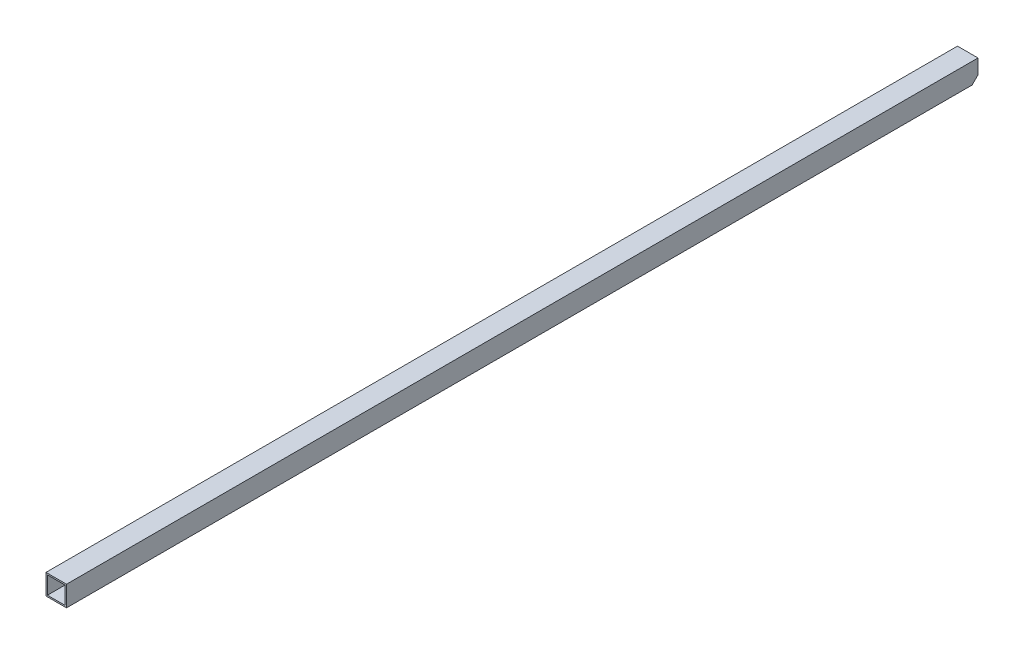
ISO-10303-21;
HEADER;
FILE_DESCRIPTION(('STEP AP214'),'2;1');
FILE_NAME('part.step','',(''),(''),'','','');
FILE_SCHEMA(('AUTOMOTIVE_DESIGN { 1 0 10303 214 1 1 1 1 }'));
ENDSEC;
DATA;
#1=APPLICATION_CONTEXT('core data for automotive mechanical design processes');
#2=APPLICATION_PROTOCOL_DEFINITION('international standard','automotive_design',2000,#1);
#3=PRODUCT_CONTEXT('',#1,'mechanical');
#4=PRODUCT('Part','Part','',(#3));
#5=PRODUCT_RELATED_PRODUCT_CATEGORY('part','',(#4));
#6=PRODUCT_DEFINITION_FORMATION('','',#4);
#7=PRODUCT_DEFINITION_CONTEXT('part definition',#1,'design');
#8=PRODUCT_DEFINITION('design','',#6,#7);
#9=PRODUCT_DEFINITION_SHAPE('','',#8);
#10=(LENGTH_UNIT() NAMED_UNIT(*) SI_UNIT(.MILLI.,.METRE.));
#11=(NAMED_UNIT(*) PLANE_ANGLE_UNIT() SI_UNIT($,.RADIAN.));
#12=(NAMED_UNIT(*) SI_UNIT($,.STERADIAN.) SOLID_ANGLE_UNIT());
#13=UNCERTAINTY_MEASURE_WITH_UNIT(LENGTH_MEASURE(1.E-05),#10,'distance_accuracy_value','');
#14=(GEOMETRIC_REPRESENTATION_CONTEXT(3) GLOBAL_UNCERTAINTY_ASSIGNED_CONTEXT((#13)) GLOBAL_UNIT_ASSIGNED_CONTEXT((#10,
#11,#12)) REPRESENTATION_CONTEXT('',''));
#15=CARTESIAN_POINT('',(0.,0.,0.));
#16=DIRECTION('',(0.,0.,1.));
#17=DIRECTION('',(1.,0.,0.));
#18=AXIS2_PLACEMENT_3D('',#15,#16,#17);
#19=CARTESIAN_POINT('',(473.075,9.525,87.043852545321));
#20=DIRECTION('',(0.,1.,0.));
#21=DIRECTION('',(0.,0.,1.));
#22=AXIS2_PLACEMENT_3D('',#19,#20,#21);
#23=PLANE('',#22);
#24=DIRECTION('',(0.,0.,-1.));
#25=VECTOR('',#24,1.);
#26=CARTESIAN_POINT('',(476.25,9.525,990.6));
#27=LINE('',#26,#25);
#28=CARTESIAN_POINT('',(476.25,9.525,1981.2));
#29=VERTEX_POINT('',#28);
#30=CARTESIAN_POINT('',(476.25,9.525,15.875));
#31=VERTEX_POINT('',#30);
#32=EDGE_CURVE('E17',#29,#31,#27,.T.);
#33=ORIENTED_EDGE('',*,*,#32,.F.);
#34=DIRECTION('',(-1.,0.,0.));
#35=VECTOR('',#34,1.);
#36=CARTESIAN_POINT('',(473.075,9.525,1981.2));
#37=LINE('',#36,#35);
#38=CARTESIAN_POINT('',(514.35,9.525,1981.2));
#39=VERTEX_POINT('',#38);
#40=EDGE_CURVE('E152',#29,#39,#37,.F.);
#41=ORIENTED_EDGE('',*,*,#40,.T.);
#42=DIRECTION('',(0.,0.,-1.));
#43=VECTOR('',#42,1.);
#44=CARTESIAN_POINT('',(514.35,9.525,990.6));
#45=LINE('',#44,#43);
#46=CARTESIAN_POINT('',(514.35,9.52500000000001,15.875));
#47=VERTEX_POINT('',#46);
#48=EDGE_CURVE('E109',#39,#47,#45,.T.);
#49=ORIENTED_EDGE('',*,*,#48,.T.);
#50=DIRECTION('',(1.,0.,0.));
#51=VECTOR('',#50,1.);
#52=CARTESIAN_POINT('',(473.075,9.525,15.875));
#53=LINE('',#52,#51);
#54=EDGE_CURVE('E87',#47,#31,#53,.F.);
#55=ORIENTED_EDGE('',*,*,#54,.T.);
#56=EDGE_LOOP('',(#33,#41,#49,#55));
#57=FACE_BOUND('',#56,.T.);
#58=ADVANCED_FACE('F14',(#57),#23,.T.);
#59=CARTESIAN_POINT('',(476.25,38.1,990.6));
#60=DIRECTION('',(1.,0.,0.));
#61=DIRECTION('',(0.,0.,-1.));
#62=AXIS2_PLACEMENT_3D('',#59,#60,#61);
#63=PLANE('',#62);
#64=DIRECTION('',(0.,1.,0.));
#65=VECTOR('',#64,1.);
#66=CARTESIAN_POINT('',(476.25,28.8192334502936,1981.2));
#67=LINE('',#66,#65);
#68=CARTESIAN_POINT('',(476.25,47.6249999999999,1981.2));
#69=VERTEX_POINT('',#68);
#70=EDGE_CURVE('E97',#69,#29,#67,.F.);
#71=ORIENTED_EDGE('',*,*,#70,.T.);
#72=ORIENTED_EDGE('',*,*,#32,.T.);
#73=DIRECTION('',(0.,-0.707106781186548,0.707106781186547));
#74=VECTOR('',#73,1.);
#75=CARTESIAN_POINT('',(476.25,6.56357332000069,18.8364266799993));
#76=LINE('',#75,#74);
#77=CARTESIAN_POINT('',(476.25,19.05,6.34999999999999));
#78=VERTEX_POINT('',#77);
#79=EDGE_CURVE('E94',#31,#78,#76,.F.);
#80=ORIENTED_EDGE('',*,*,#79,.T.);
#81=DIRECTION('',(0.,-1.,0.));
#82=VECTOR('',#81,1.);
#83=CARTESIAN_POINT('',(476.25,41.275,6.35));
#84=LINE('',#83,#82);
#85=CARTESIAN_POINT('',(476.25,47.625,6.34999999999998));
#86=VERTEX_POINT('',#85);
#87=EDGE_CURVE('E127',#78,#86,#84,.F.);
#88=ORIENTED_EDGE('',*,*,#87,.T.);
#89=DIRECTION('',(0.,0.,-1.));
#90=VECTOR('',#89,1.);
#91=CARTESIAN_POINT('',(476.25,47.625,75.4673129796982));
#92=LINE('',#91,#90);
#93=EDGE_CURVE('E101',#69,#86,#92,.T.);
#94=ORIENTED_EDGE('',*,*,#93,.F.);
#95=EDGE_LOOP('',(#71,#72,#80,#88,#94));
#96=FACE_BOUND('',#95,.T.);
#97=ADVANCED_FACE('F92',(#96),#63,.T.);
#98=CARTESIAN_POINT('',(473.075,47.625,75.4673129796982));
#99=DIRECTION('',(0.,-1.,0.));
#100=DIRECTION('',(0.,0.,-1.));
#101=AXIS2_PLACEMENT_3D('',#98,#99,#100);
#102=PLANE('',#101);
#103=ORIENTED_EDGE('',*,*,#93,.T.);
#104=DIRECTION('',(1.,0.,0.));
#105=VECTOR('',#104,1.);
#106=CARTESIAN_POINT('',(473.075,47.625,6.35));
#107=LINE('',#106,#105);
#108=CARTESIAN_POINT('',(514.35,47.625,6.34999999999999));
#109=VERTEX_POINT('',#108);
#110=EDGE_CURVE('E122',#86,#109,#107,.T.);
#111=ORIENTED_EDGE('',*,*,#110,.T.);
#112=DIRECTION('',(0.,0.,-1.));
#113=VECTOR('',#112,1.);
#114=CARTESIAN_POINT('',(514.35,47.625,990.6));
#115=LINE('',#114,#113);
#116=CARTESIAN_POINT('',(514.35,47.6249999999999,1981.2));
#117=VERTEX_POINT('',#116);
#118=EDGE_CURVE('E112',#109,#117,#115,.F.);
#119=ORIENTED_EDGE('',*,*,#118,.T.);
#120=DIRECTION('',(-1.,0.,0.));
#121=VECTOR('',#120,1.);
#122=CARTESIAN_POINT('',(473.075,47.625,1981.2));
#123=LINE('',#122,#121);
#124=EDGE_CURVE('E123',#117,#69,#123,.T.);
#125=ORIENTED_EDGE('',*,*,#124,.T.);
#126=EDGE_LOOP('',(#103,#111,#119,#125));
#127=FACE_BOUND('',#126,.T.);
#128=ADVANCED_FACE('F121',(#127),#102,.T.);
#129=CARTESIAN_POINT('',(514.35,38.1,990.6));
#130=DIRECTION('',(1.,0.,0.));
#131=DIRECTION('',(0.,0.,-1.));
#132=AXIS2_PLACEMENT_3D('',#129,#130,#131);
#133=PLANE('',#132);
#134=ORIENTED_EDGE('',*,*,#48,.F.);
#135=DIRECTION('',(0.,1.,0.));
#136=VECTOR('',#135,1.);
#137=CARTESIAN_POINT('',(514.35,28.8192334502936,1981.2));
#138=LINE('',#137,#136);
#139=EDGE_CURVE('E149',#39,#117,#138,.T.);
#140=ORIENTED_EDGE('',*,*,#139,.T.);
#141=ORIENTED_EDGE('',*,*,#118,.F.);
#142=DIRECTION('',(0.,-1.,0.));
#143=VECTOR('',#142,1.);
#144=CARTESIAN_POINT('',(514.35,41.275,6.35));
#145=LINE('',#144,#143);
#146=CARTESIAN_POINT('',(514.35,19.05,6.34999999999999));
#147=VERTEX_POINT('',#146);
#148=EDGE_CURVE('E130',#109,#147,#145,.T.);
#149=ORIENTED_EDGE('',*,*,#148,.T.);
#150=DIRECTION('',(0.,-0.707106781186548,0.707106781186547));
#151=VECTOR('',#150,1.);
#152=CARTESIAN_POINT('',(514.35,6.56357332000069,18.8364266799993));
#153=LINE('',#152,#151);
#154=EDGE_CURVE('E107',#147,#47,#153,.T.);
#155=ORIENTED_EDGE('',*,*,#154,.T.);
#156=EDGE_LOOP('',(#134,#140,#141,#149,#155));
#157=FACE_BOUND('',#156,.T.);
#158=ADVANCED_FACE('F160',(#157),#133,.F.);
#159=CARTESIAN_POINT('',(473.075,6.56357332000069,18.8364266799993));
#160=DIRECTION('',(0.,0.707106781186547,0.707106781186548));
#161=DIRECTION('',(0.,-0.707106781186548,0.707106781186547));
#162=AXIS2_PLACEMENT_3D('',#159,#160,#161);
#163=PLANE('',#162);
#164=DIRECTION('',(1.,0.,0.));
#165=VECTOR('',#164,1.);
#166=CARTESIAN_POINT('',(473.075,19.05,6.35));
#167=LINE('',#166,#165);
#168=CARTESIAN_POINT('',(517.525,19.05,6.34999999999999));
#169=VERTEX_POINT('',#168);
#170=EDGE_CURVE('E139',#147,#169,#167,.T.);
#171=ORIENTED_EDGE('',*,*,#170,.T.);
#172=DIRECTION('',(0.,0.707106781186546,-0.707106781186549));
#173=VECTOR('',#172,1.);
#174=CARTESIAN_POINT('',(517.525,6.35,19.05));
#175=LINE('',#174,#173);
#176=CARTESIAN_POINT('',(517.525,6.35,19.05));
#177=VERTEX_POINT('',#176);
#178=EDGE_CURVE('E166',#177,#169,#175,.T.);
#179=ORIENTED_EDGE('',*,*,#178,.F.);
#180=DIRECTION('',(1.,0.,0.));
#181=VECTOR('',#180,1.);
#182=CARTESIAN_POINT('',(473.075,6.35,19.05));
#183=LINE('',#182,#181);
#184=CARTESIAN_POINT('',(473.075,6.35,19.05));
#185=VERTEX_POINT('',#184);
#186=EDGE_CURVE('E158',#177,#185,#183,.F.);
#187=ORIENTED_EDGE('',*,*,#186,.T.);
#188=DIRECTION('',(0.,0.707106781186546,-0.707106781186549));
#189=VECTOR('',#188,1.);
#190=CARTESIAN_POINT('',(473.075,6.35,19.05));
#191=LINE('',#190,#189);
#192=CARTESIAN_POINT('',(473.075,19.05,6.34999999999998));
#193=VERTEX_POINT('',#192);
#194=EDGE_CURVE('E141',#185,#193,#191,.T.);
#195=ORIENTED_EDGE('',*,*,#194,.T.);
#196=DIRECTION('',(1.,0.,0.));
#197=VECTOR('',#196,1.);
#198=CARTESIAN_POINT('',(473.075,19.05,6.35));
#199=LINE('',#198,#197);
#200=EDGE_CURVE('E106',#193,#78,#199,.T.);
#201=ORIENTED_EDGE('',*,*,#200,.T.);
#202=ORIENTED_EDGE('',*,*,#79,.F.);
#203=ORIENTED_EDGE('',*,*,#54,.F.);
#204=ORIENTED_EDGE('',*,*,#154,.F.);
#205=EDGE_LOOP('',(#171,#179,#187,#195,#201,#202,#203,#204));
#206=FACE_BOUND('',#205,.T.);
#207=ADVANCED_FACE('F104',(#206),#163,.F.);
#208=CARTESIAN_POINT('',(473.075,6.35,87.043852545321));
#209=DIRECTION('',(0.,1.,0.));
#210=DIRECTION('',(0.,0.,1.));
#211=AXIS2_PLACEMENT_3D('',#208,#209,#210);
#212=PLANE('',#211);
#213=DIRECTION('',(-1.,0.,0.));
#214=VECTOR('',#213,1.);
#215=CARTESIAN_POINT('',(473.075,6.35,1981.2));
#216=LINE('',#215,#214);
#217=CARTESIAN_POINT('',(517.525,6.35,1981.2));
#218=VERTEX_POINT('',#217);
#219=CARTESIAN_POINT('',(473.075,6.35,1981.2));
#220=VERTEX_POINT('',#219);
#221=EDGE_CURVE('E156',#218,#220,#216,.T.);
#222=ORIENTED_EDGE('',*,*,#221,.T.);
#223=DIRECTION('',(0.,0.,-1.));
#224=VECTOR('',#223,1.);
#225=CARTESIAN_POINT('',(473.075,6.35,990.6));
#226=LINE('',#225,#224);
#227=EDGE_CURVE('E143',#220,#185,#226,.T.);
#228=ORIENTED_EDGE('',*,*,#227,.T.);
#229=ORIENTED_EDGE('',*,*,#186,.F.);
#230=DIRECTION('',(0.,0.,-1.));
#231=VECTOR('',#230,1.);
#232=CARTESIAN_POINT('',(517.525,6.35,990.6));
#233=LINE('',#232,#231);
#234=EDGE_CURVE('E169',#218,#177,#233,.T.);
#235=ORIENTED_EDGE('',*,*,#234,.F.);
#236=EDGE_LOOP('',(#222,#228,#229,#235));
#237=FACE_BOUND('',#236,.T.);
#238=ADVANCED_FACE('F207',(#237),#212,.F.);
#239=CARTESIAN_POINT('',(473.075,28.8192334502936,1981.2));
#240=DIRECTION('',(0.,0.,-1.));
#241=DIRECTION('',(-1.,0.,0.));
#242=AXIS2_PLACEMENT_3D('',#239,#240,#241);
#243=PLANE('',#242);
#244=ORIENTED_EDGE('',*,*,#40,.F.);
#245=ORIENTED_EDGE('',*,*,#70,.F.);
#246=ORIENTED_EDGE('',*,*,#124,.F.);
#247=ORIENTED_EDGE('',*,*,#139,.F.);
#248=EDGE_LOOP('',(#244,#245,#246,#247));
#249=FACE_BOUND('',#248,.T.);
#250=DIRECTION('',(1.,0.,0.));
#251=VECTOR('',#250,1.);
#252=CARTESIAN_POINT('',(473.075,50.7999999999998,1981.2));
#253=LINE('',#252,#251);
#254=CARTESIAN_POINT('',(517.525,50.7999999999999,1981.2));
#255=VERTEX_POINT('',#254);
#256=CARTESIAN_POINT('',(473.075,50.7999999999999,1981.2));
#257=VERTEX_POINT('',#256);
#258=EDGE_CURVE('E175',#255,#257,#253,.F.);
#259=ORIENTED_EDGE('',*,*,#258,.T.);
#260=DIRECTION('',(0.,1.,0.));
#261=VECTOR('',#260,1.);
#262=CARTESIAN_POINT('',(473.075,38.1,1981.2));
#263=LINE('',#262,#261);
#264=EDGE_CURVE('E146',#257,#220,#263,.F.);
#265=ORIENTED_EDGE('',*,*,#264,.T.);
#266=ORIENTED_EDGE('',*,*,#221,.F.);
#267=DIRECTION('',(0.,1.,0.));
#268=VECTOR('',#267,1.);
#269=CARTESIAN_POINT('',(517.525,38.1,1981.2));
#270=LINE('',#269,#268);
#271=EDGE_CURVE('E165',#255,#218,#270,.F.);
#272=ORIENTED_EDGE('',*,*,#271,.F.);
#273=EDGE_LOOP('',(#259,#265,#266,#272));
#274=FACE_BOUND('',#273,.T.);
#275=ADVANCED_FACE('F190',(#249,#274),#243,.F.);
#276=CARTESIAN_POINT('',(473.075,38.1,990.6));
#277=DIRECTION('',(1.,0.,0.));
#278=DIRECTION('',(0.,0.,-1.));
#279=AXIS2_PLACEMENT_3D('',#276,#277,#278);
#280=PLANE('',#279);
#281=ORIENTED_EDGE('',*,*,#227,.F.);
#282=ORIENTED_EDGE('',*,*,#264,.F.);
#283=DIRECTION('',(0.,0.,-1.));
#284=VECTOR('',#283,1.);
#285=CARTESIAN_POINT('',(473.075,50.8,75.4673129796982));
#286=LINE('',#285,#284);
#287=CARTESIAN_POINT('',(473.075,50.8,6.34999999999998));
#288=VERTEX_POINT('',#287);
#289=EDGE_CURVE('E178',#257,#288,#286,.T.);
#290=ORIENTED_EDGE('',*,*,#289,.T.);
#291=DIRECTION('',(0.,-1.,0.));
#292=VECTOR('',#291,1.);
#293=CARTESIAN_POINT('',(473.075,41.275,6.35));
#294=LINE('',#293,#292);
#295=EDGE_CURVE('E133',#288,#193,#294,.T.);
#296=ORIENTED_EDGE('',*,*,#295,.T.);
#297=ORIENTED_EDGE('',*,*,#194,.F.);
#298=EDGE_LOOP('',(#281,#282,#290,#296,#297));
#299=FACE_BOUND('',#298,.T.);
#300=ADVANCED_FACE('F184',(#299),#280,.F.);
#301=CARTESIAN_POINT('',(473.075,41.275,6.35));
#302=DIRECTION('',(0.,0.,1.));
#303=DIRECTION('',(0.,-1.,0.));
#304=AXIS2_PLACEMENT_3D('',#301,#302,#303);
#305=PLANE('',#304);
#306=ORIENTED_EDGE('',*,*,#110,.F.);
#307=ORIENTED_EDGE('',*,*,#87,.F.);
#308=ORIENTED_EDGE('',*,*,#200,.F.);
#309=ORIENTED_EDGE('',*,*,#295,.F.);
#310=DIRECTION('',(1.,0.,0.));
#311=VECTOR('',#310,1.);
#312=CARTESIAN_POINT('',(473.075,50.8,6.34999999999999));
#313=LINE('',#312,#311);
#314=CARTESIAN_POINT('',(517.525,50.8,6.34999999999999));
#315=VERTEX_POINT('',#314);
#316=EDGE_CURVE('E23',#288,#315,#313,.T.);
#317=ORIENTED_EDGE('',*,*,#316,.T.);
#318=DIRECTION('',(0.,1.,0.));
#319=VECTOR('',#318,1.);
#320=CARTESIAN_POINT('',(517.525,38.1,6.34999999999997));
#321=LINE('',#320,#319);
#322=EDGE_CURVE('E31',#169,#315,#321,.T.);
#323=ORIENTED_EDGE('',*,*,#322,.F.);
#324=ORIENTED_EDGE('',*,*,#170,.F.);
#325=ORIENTED_EDGE('',*,*,#148,.F.);
#326=EDGE_LOOP('',(#306,#307,#308,#309,#317,#323,#324,#325));
#327=FACE_BOUND('',#326,.T.);
#328=ADVANCED_FACE('F126',(#327),#305,.F.);
#329=CARTESIAN_POINT('',(517.525,38.1,990.6));
#330=DIRECTION('',(1.,0.,0.));
#331=DIRECTION('',(0.,0.,-1.));
#332=AXIS2_PLACEMENT_3D('',#329,#330,#331);
#333=PLANE('',#332);
#334=ORIENTED_EDGE('',*,*,#271,.T.);
#335=ORIENTED_EDGE('',*,*,#234,.T.);
#336=ORIENTED_EDGE('',*,*,#178,.T.);
#337=ORIENTED_EDGE('',*,*,#322,.T.);
#338=DIRECTION('',(0.,0.,-1.));
#339=VECTOR('',#338,1.);
#340=CARTESIAN_POINT('',(517.525,50.8,75.4673129796982));
#341=LINE('',#340,#339);
#342=EDGE_CURVE('E9',#315,#255,#341,.F.);
#343=ORIENTED_EDGE('',*,*,#342,.T.);
#344=EDGE_LOOP('',(#334,#335,#336,#337,#343));
#345=FACE_BOUND('',#344,.T.);
#346=ADVANCED_FACE('F192',(#345),#333,.T.);
#347=CARTESIAN_POINT('',(473.075,50.8,75.4673129796982));
#348=DIRECTION('',(0.,-1.,0.));
#349=DIRECTION('',(0.,0.,-1.));
#350=AXIS2_PLACEMENT_3D('',#347,#348,#349);
#351=PLANE('',#350);
#352=ORIENTED_EDGE('',*,*,#316,.F.);
#353=ORIENTED_EDGE('',*,*,#289,.F.);
#354=ORIENTED_EDGE('',*,*,#258,.F.);
#355=ORIENTED_EDGE('',*,*,#342,.F.);
#356=EDGE_LOOP('',(#352,#353,#354,#355));
#357=FACE_BOUND('',#356,.T.);
#358=ADVANCED_FACE('F187',(#357),#351,.F.);
#359=CLOSED_SHELL('',(#58,#97,#128,#158,#207,#238,#275,#300,#328,#346,#358));
#360=MANIFOLD_SOLID_BREP('B1',#359);
#361=ADVANCED_BREP_SHAPE_REPRESENTATION('',(#18,#360),#14);
#362=SHAPE_DEFINITION_REPRESENTATION(#9,#361);
ENDSEC;
END-ISO-10303-21;
